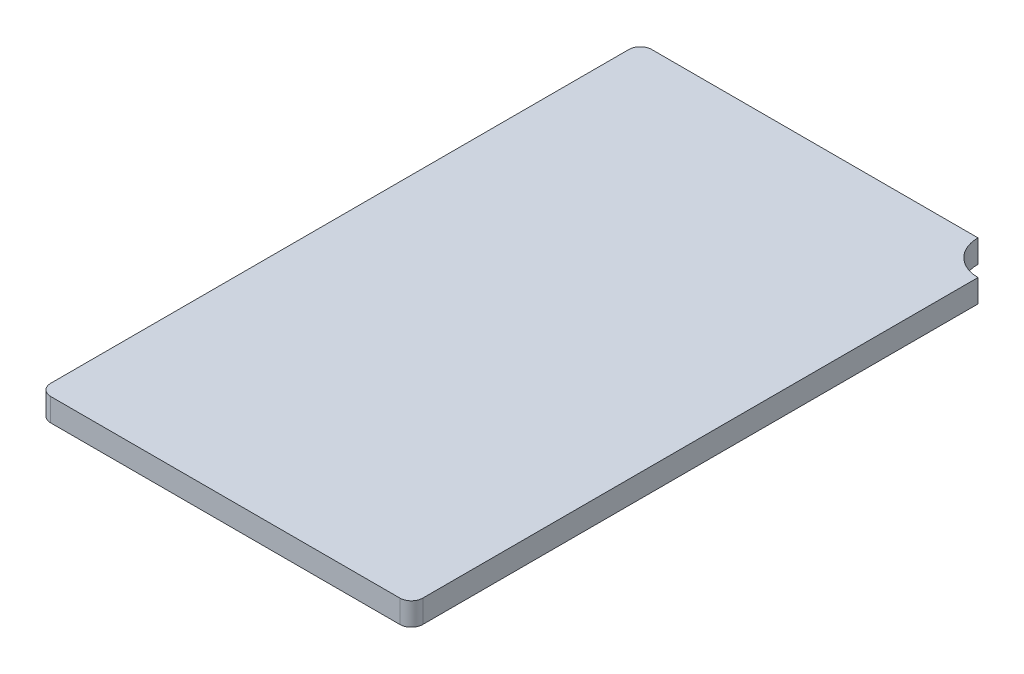
ISO-10303-21;
HEADER;
FILE_DESCRIPTION(('STEP AP214'),'2;1');
FILE_NAME('part.step','',(''),(''),'','','');
FILE_SCHEMA(('AUTOMOTIVE_DESIGN { 1 0 10303 214 1 1 1 1 }'));
ENDSEC;
DATA;
#1=APPLICATION_CONTEXT('core data for automotive mechanical design processes');
#2=APPLICATION_PROTOCOL_DEFINITION('international standard','automotive_design',2000,#1);
#3=PRODUCT_CONTEXT('',#1,'mechanical');
#4=PRODUCT('Part','Part','',(#3));
#5=PRODUCT_RELATED_PRODUCT_CATEGORY('part','',(#4));
#6=PRODUCT_DEFINITION_FORMATION('','',#4);
#7=PRODUCT_DEFINITION_CONTEXT('part definition',#1,'design');
#8=PRODUCT_DEFINITION('design','',#6,#7);
#9=PRODUCT_DEFINITION_SHAPE('','',#8);
#10=(LENGTH_UNIT() NAMED_UNIT(*) SI_UNIT(.MILLI.,.METRE.));
#11=(NAMED_UNIT(*) PLANE_ANGLE_UNIT() SI_UNIT($,.RADIAN.));
#12=(NAMED_UNIT(*) SI_UNIT($,.STERADIAN.) SOLID_ANGLE_UNIT());
#13=UNCERTAINTY_MEASURE_WITH_UNIT(LENGTH_MEASURE(1.E-05),#10,'distance_accuracy_value','');
#14=(GEOMETRIC_REPRESENTATION_CONTEXT(3) GLOBAL_UNCERTAINTY_ASSIGNED_CONTEXT((#13)) GLOBAL_UNIT_ASSIGNED_CONTEXT((#10,
#11,#12)) REPRESENTATION_CONTEXT('',''));
#15=CARTESIAN_POINT('',(0.,0.,0.));
#16=DIRECTION('',(0.,0.,1.));
#17=DIRECTION('',(1.,0.,0.));
#18=AXIS2_PLACEMENT_3D('',#15,#16,#17);
#19=CARTESIAN_POINT('',(1.625,0.2,-2.625));
#20=DIRECTION('',(-1.,0.,0.));
#21=DIRECTION('',(0.,0.,1.));
#22=AXIS2_PLACEMENT_3D('',#19,#20,#21);
#23=PLANE('',#22);
#24=DIRECTION('',(0.,0.,-1.));
#25=VECTOR('',#24,1.);
#26=CARTESIAN_POINT('',(1.625,0.2,-2.625));
#27=LINE('',#26,#25);
#28=CARTESIAN_POINT('',(1.625,0.2,2.525));
#29=VERTEX_POINT('',#28);
#30=CARTESIAN_POINT('',(1.625,0.2,-2.325));
#31=VERTEX_POINT('',#30);
#32=EDGE_CURVE('E133',#29,#31,#27,.T.);
#33=ORIENTED_EDGE('',*,*,#32,.F.);
#34=DIRECTION('',(0.,-1.,0.));
#35=VECTOR('',#34,1.);
#36=CARTESIAN_POINT('',(1.625,0.2,2.525));
#37=LINE('',#36,#35);
#38=CARTESIAN_POINT('',(1.625,0.,2.525));
#39=VERTEX_POINT('',#38);
#40=EDGE_CURVE('E109',#29,#39,#37,.T.);
#41=ORIENTED_EDGE('',*,*,#40,.T.);
#42=DIRECTION('',(0.,0.,-1.));
#43=VECTOR('',#42,1.);
#44=CARTESIAN_POINT('',(1.625,0.,-2.625));
#45=LINE('',#44,#43);
#46=CARTESIAN_POINT('',(1.625,0.,-2.325));
#47=VERTEX_POINT('',#46);
#48=EDGE_CURVE('E125',#39,#47,#45,.T.);
#49=ORIENTED_EDGE('',*,*,#48,.T.);
#50=DIRECTION('',(0.,1.,0.));
#51=VECTOR('',#50,1.);
#52=CARTESIAN_POINT('',(1.625,0.,-2.325));
#53=LINE('',#52,#51);
#54=EDGE_CURVE('E105',#47,#31,#53,.T.);
#55=ORIENTED_EDGE('',*,*,#54,.T.);
#56=EDGE_LOOP('',(#33,#41,#49,#55));
#57=FACE_BOUND('',#56,.T.);
#58=ADVANCED_FACE('F33',(#57),#23,.F.);
#59=CARTESIAN_POINT('',(-1.625,0.2,-2.625));
#60=DIRECTION('',(0.,0.,1.));
#61=DIRECTION('',(1.,0.,0.));
#62=AXIS2_PLACEMENT_3D('',#59,#60,#61);
#63=PLANE('',#62);
#64=DIRECTION('',(-1.,0.,0.));
#65=VECTOR('',#64,1.);
#66=CARTESIAN_POINT('',(-1.625,0.,-2.625));
#67=LINE('',#66,#65);
#68=CARTESIAN_POINT('',(1.325,0.,-2.625));
#69=VERTEX_POINT('',#68);
#70=CARTESIAN_POINT('',(-1.525,0.,-2.625));
#71=VERTEX_POINT('',#70);
#72=EDGE_CURVE('E116',#69,#71,#67,.T.);
#73=ORIENTED_EDGE('',*,*,#72,.T.);
#74=DIRECTION('',(0.,-1.,0.));
#75=VECTOR('',#74,1.);
#76=CARTESIAN_POINT('',(-1.525,0.2,-2.625));
#77=LINE('',#76,#75);
#78=CARTESIAN_POINT('',(-1.525,0.2,-2.625));
#79=VERTEX_POINT('',#78);
#80=EDGE_CURVE('E11',#71,#79,#77,.F.);
#81=ORIENTED_EDGE('',*,*,#80,.T.);
#82=DIRECTION('',(-1.,0.,0.));
#83=VECTOR('',#82,1.);
#84=CARTESIAN_POINT('',(-1.625,0.2,-2.625));
#85=LINE('',#84,#83);
#86=CARTESIAN_POINT('',(1.325,0.2,-2.625));
#87=VERTEX_POINT('',#86);
#88=EDGE_CURVE('E118',#87,#79,#85,.T.);
#89=ORIENTED_EDGE('',*,*,#88,.F.);
#90=DIRECTION('',(0.,1.,0.));
#91=VECTOR('',#90,1.);
#92=CARTESIAN_POINT('',(1.325,0.,-2.625));
#93=LINE('',#92,#91);
#94=EDGE_CURVE('E102',#87,#69,#93,.F.);
#95=ORIENTED_EDGE('',*,*,#94,.T.);
#96=EDGE_LOOP('',(#73,#81,#89,#95));
#97=FACE_BOUND('',#96,.T.);
#98=ADVANCED_FACE('F115',(#97),#63,.F.);
#99=CARTESIAN_POINT('',(-1.625,0.2,-2.625));
#100=DIRECTION('',(1.,0.,0.));
#101=DIRECTION('',(0.,0.,-1.));
#102=AXIS2_PLACEMENT_3D('',#99,#100,#101);
#103=PLANE('',#102);
#104=DIRECTION('',(0.,0.,1.));
#105=VECTOR('',#104,1.);
#106=CARTESIAN_POINT('',(-1.625,0.,-2.625));
#107=LINE('',#106,#105);
#108=CARTESIAN_POINT('',(-1.625,0.,-2.525));
#109=VERTEX_POINT('',#108);
#110=CARTESIAN_POINT('',(-1.625,0.,2.525));
#111=VERTEX_POINT('',#110);
#112=EDGE_CURVE('E124',#109,#111,#107,.T.);
#113=ORIENTED_EDGE('',*,*,#112,.T.);
#114=DIRECTION('',(0.,-1.,0.));
#115=VECTOR('',#114,1.);
#116=CARTESIAN_POINT('',(-1.625,0.2,2.525));
#117=LINE('',#116,#115);
#118=CARTESIAN_POINT('',(-1.625,0.2,2.525));
#119=VERTEX_POINT('',#118);
#120=EDGE_CURVE('E41',#111,#119,#117,.F.);
#121=ORIENTED_EDGE('',*,*,#120,.T.);
#122=DIRECTION('',(0.,0.,1.));
#123=VECTOR('',#122,1.);
#124=CARTESIAN_POINT('',(-1.625,0.2,-2.625));
#125=LINE('',#124,#123);
#126=CARTESIAN_POINT('',(-1.625,0.2,-2.525));
#127=VERTEX_POINT('',#126);
#128=EDGE_CURVE('E156',#127,#119,#125,.T.);
#129=ORIENTED_EDGE('',*,*,#128,.F.);
#130=DIRECTION('',(0.,-1.,0.));
#131=VECTOR('',#130,1.);
#132=CARTESIAN_POINT('',(-1.625,0.2,-2.525));
#133=LINE('',#132,#131);
#134=EDGE_CURVE('E152',#127,#109,#133,.T.);
#135=ORIENTED_EDGE('',*,*,#134,.T.);
#136=EDGE_LOOP('',(#113,#121,#129,#135));
#137=FACE_BOUND('',#136,.T.);
#138=ADVANCED_FACE('F155',(#137),#103,.F.);
#139=CARTESIAN_POINT('',(-1.625,0.2,2.625));
#140=DIRECTION('',(0.,0.,-1.));
#141=DIRECTION('',(-1.,0.,0.));
#142=AXIS2_PLACEMENT_3D('',#139,#140,#141);
#143=PLANE('',#142);
#144=DIRECTION('',(1.,0.,0.));
#145=VECTOR('',#144,1.);
#146=CARTESIAN_POINT('',(-1.625,0.,2.625));
#147=LINE('',#146,#145);
#148=CARTESIAN_POINT('',(-1.525,0.,2.625));
#149=VERTEX_POINT('',#148);
#150=CARTESIAN_POINT('',(1.525,0.,2.625));
#151=VERTEX_POINT('',#150);
#152=EDGE_CURVE('E127',#149,#151,#147,.T.);
#153=ORIENTED_EDGE('',*,*,#152,.T.);
#154=DIRECTION('',(0.,-1.,0.));
#155=VECTOR('',#154,1.);
#156=CARTESIAN_POINT('',(1.525,0.2,2.625));
#157=LINE('',#156,#155);
#158=CARTESIAN_POINT('',(1.525,0.2,2.625));
#159=VERTEX_POINT('',#158);
#160=EDGE_CURVE('E145',#151,#159,#157,.F.);
#161=ORIENTED_EDGE('',*,*,#160,.T.);
#162=DIRECTION('',(1.,0.,0.));
#163=VECTOR('',#162,1.);
#164=CARTESIAN_POINT('',(-1.625,0.2,2.625));
#165=LINE('',#164,#163);
#166=CARTESIAN_POINT('',(-1.525,0.2,2.625));
#167=VERTEX_POINT('',#166);
#168=EDGE_CURVE('E110',#167,#159,#165,.T.);
#169=ORIENTED_EDGE('',*,*,#168,.F.);
#170=DIRECTION('',(0.,-1.,0.));
#171=VECTOR('',#170,1.);
#172=CARTESIAN_POINT('',(-1.525,0.2,2.625));
#173=LINE('',#172,#171);
#174=EDGE_CURVE('E142',#167,#149,#173,.T.);
#175=ORIENTED_EDGE('',*,*,#174,.T.);
#176=EDGE_LOOP('',(#153,#161,#169,#175));
#177=FACE_BOUND('',#176,.T.);
#178=ADVANCED_FACE('F165',(#177),#143,.F.);
#179=CARTESIAN_POINT('',(0.,0.2,0.));
#180=DIRECTION('',(0.,1.,0.));
#181=DIRECTION('',(0.,0.,1.));
#182=AXIS2_PLACEMENT_3D('',#179,#180,#181);
#183=PLANE('',#182);
#184=ORIENTED_EDGE('',*,*,#168,.T.);
#185=CARTESIAN_POINT('',(1.525,0.2,2.525));
#186=DIRECTION('',(0.,1.,0.));
#187=DIRECTION('',(0.,0.,1.));
#188=AXIS2_PLACEMENT_3D('',#185,#186,#187);
#189=CIRCLE('',#188,0.1);
#190=EDGE_CURVE('E150',#159,#29,#189,.T.);
#191=ORIENTED_EDGE('',*,*,#190,.T.);
#192=ORIENTED_EDGE('',*,*,#32,.T.);
#193=CARTESIAN_POINT('',(1.625,0.2,-2.625));
#194=DIRECTION('',(0.,1.,0.));
#195=DIRECTION('',(0.,0.,1.));
#196=AXIS2_PLACEMENT_3D('',#193,#194,#195);
#197=CIRCLE('',#196,0.3);
#198=EDGE_CURVE('E119',#87,#31,#197,.T.);
#199=ORIENTED_EDGE('',*,*,#198,.F.);
#200=ORIENTED_EDGE('',*,*,#88,.T.);
#201=CARTESIAN_POINT('',(-1.525,0.2,-2.525));
#202=DIRECTION('',(0.,1.,0.));
#203=DIRECTION('',(0.,0.,1.));
#204=AXIS2_PLACEMENT_3D('',#201,#202,#203);
#205=CIRCLE('',#204,0.1);
#206=EDGE_CURVE('E54',#79,#127,#205,.T.);
#207=ORIENTED_EDGE('',*,*,#206,.T.);
#208=ORIENTED_EDGE('',*,*,#128,.T.);
#209=CARTESIAN_POINT('',(-1.525,0.2,2.525));
#210=DIRECTION('',(0.,1.,0.));
#211=DIRECTION('',(0.,0.,1.));
#212=AXIS2_PLACEMENT_3D('',#209,#210,#211);
#213=CIRCLE('',#212,0.1);
#214=EDGE_CURVE('E148',#119,#167,#213,.T.);
#215=ORIENTED_EDGE('',*,*,#214,.T.);
#216=EDGE_LOOP('',(#184,#191,#192,#199,#200,#207,#208,#215));
#217=FACE_BOUND('',#216,.T.);
#218=ADVANCED_FACE('F179',(#217),#183,.T.);
#219=CARTESIAN_POINT('',(0.,0.,0.));
#220=DIRECTION('',(0.,1.,0.));
#221=DIRECTION('',(0.,0.,1.));
#222=AXIS2_PLACEMENT_3D('',#219,#220,#221);
#223=PLANE('',#222);
#224=ORIENTED_EDGE('',*,*,#48,.F.);
#225=CARTESIAN_POINT('',(1.525,0.,2.525));
#226=DIRECTION('',(0.,1.,0.));
#227=DIRECTION('',(0.,0.,1.));
#228=AXIS2_PLACEMENT_3D('',#225,#226,#227);
#229=CIRCLE('',#228,0.1);
#230=EDGE_CURVE('E140',#39,#151,#229,.F.);
#231=ORIENTED_EDGE('',*,*,#230,.T.);
#232=ORIENTED_EDGE('',*,*,#152,.F.);
#233=CARTESIAN_POINT('',(-1.525,0.,2.525));
#234=DIRECTION('',(0.,1.,0.));
#235=DIRECTION('',(0.,0.,1.));
#236=AXIS2_PLACEMENT_3D('',#233,#234,#235);
#237=CIRCLE('',#236,0.1);
#238=EDGE_CURVE('E138',#149,#111,#237,.F.);
#239=ORIENTED_EDGE('',*,*,#238,.T.);
#240=ORIENTED_EDGE('',*,*,#112,.F.);
#241=CARTESIAN_POINT('',(-1.525,0.,-2.525));
#242=DIRECTION('',(0.,1.,0.));
#243=DIRECTION('',(0.,0.,1.));
#244=AXIS2_PLACEMENT_3D('',#241,#242,#243);
#245=CIRCLE('',#244,0.1);
#246=EDGE_CURVE('E123',#109,#71,#245,.F.);
#247=ORIENTED_EDGE('',*,*,#246,.T.);
#248=ORIENTED_EDGE('',*,*,#72,.F.);
#249=CARTESIAN_POINT('',(1.625,0.,-2.625));
#250=DIRECTION('',(0.,1.,0.));
#251=DIRECTION('',(0.,0.,1.));
#252=AXIS2_PLACEMENT_3D('',#249,#250,#251);
#253=CIRCLE('',#252,0.3);
#254=EDGE_CURVE('E98',#69,#47,#253,.T.);
#255=ORIENTED_EDGE('',*,*,#254,.T.);
#256=EDGE_LOOP('',(#224,#231,#232,#239,#240,#247,#248,#255));
#257=FACE_BOUND('',#256,.T.);
#258=ADVANCED_FACE('F121',(#257),#223,.F.);
#259=CARTESIAN_POINT('',(1.625,0.,-2.625));
#260=DIRECTION('',(0.,1.,0.));
#261=DIRECTION('',(0.,0.,1.));
#262=AXIS2_PLACEMENT_3D('',#259,#260,#261);
#263=CYLINDRICAL_SURFACE('',#262,0.3);
#264=ORIENTED_EDGE('',*,*,#254,.F.);
#265=ORIENTED_EDGE('',*,*,#94,.F.);
#266=ORIENTED_EDGE('',*,*,#198,.T.);
#267=ORIENTED_EDGE('',*,*,#54,.F.);
#268=EDGE_LOOP('',(#264,#265,#266,#267));
#269=FACE_BOUND('',#268,.T.);
#270=ADVANCED_FACE('F100',(#269),#263,.F.);
#271=CARTESIAN_POINT('',(1.525,0.2,2.525));
#272=DIRECTION('',(0.,-1.,0.));
#273=DIRECTION('',(0.,0.,-1.));
#274=AXIS2_PLACEMENT_3D('',#271,#272,#273);
#275=CYLINDRICAL_SURFACE('',#274,0.1);
#276=ORIENTED_EDGE('',*,*,#190,.F.);
#277=ORIENTED_EDGE('',*,*,#160,.F.);
#278=ORIENTED_EDGE('',*,*,#230,.F.);
#279=ORIENTED_EDGE('',*,*,#40,.F.);
#280=EDGE_LOOP('',(#276,#277,#278,#279));
#281=FACE_BOUND('',#280,.T.);
#282=ADVANCED_FACE('F178',(#281),#275,.T.);
#283=CARTESIAN_POINT('',(-1.525,0.2,2.525));
#284=DIRECTION('',(0.,-1.,0.));
#285=DIRECTION('',(0.,0.,-1.));
#286=AXIS2_PLACEMENT_3D('',#283,#284,#285);
#287=CYLINDRICAL_SURFACE('',#286,0.1);
#288=ORIENTED_EDGE('',*,*,#214,.F.);
#289=ORIENTED_EDGE('',*,*,#120,.F.);
#290=ORIENTED_EDGE('',*,*,#238,.F.);
#291=ORIENTED_EDGE('',*,*,#174,.F.);
#292=EDGE_LOOP('',(#288,#289,#290,#291));
#293=FACE_BOUND('',#292,.T.);
#294=ADVANCED_FACE('F162',(#293),#287,.T.);
#295=CARTESIAN_POINT('',(-1.525,0.2,-2.525));
#296=DIRECTION('',(0.,-1.,0.));
#297=DIRECTION('',(0.,0.,-1.));
#298=AXIS2_PLACEMENT_3D('',#295,#296,#297);
#299=CYLINDRICAL_SURFACE('',#298,0.1);
#300=ORIENTED_EDGE('',*,*,#206,.F.);
#301=ORIENTED_EDGE('',*,*,#80,.F.);
#302=ORIENTED_EDGE('',*,*,#246,.F.);
#303=ORIENTED_EDGE('',*,*,#134,.F.);
#304=EDGE_LOOP('',(#300,#301,#302,#303));
#305=FACE_BOUND('',#304,.T.);
#306=ADVANCED_FACE('F35',(#305),#299,.T.);
#307=CLOSED_SHELL('',(#58,#98,#138,#178,#218,#258,#270,#282,#294,#306));
#308=MANIFOLD_SOLID_BREP('B2',#307);
#309=ADVANCED_BREP_SHAPE_REPRESENTATION('',(#18,#308),#14);
#310=SHAPE_DEFINITION_REPRESENTATION(#9,#309);
ENDSEC;
END-ISO-10303-21;
